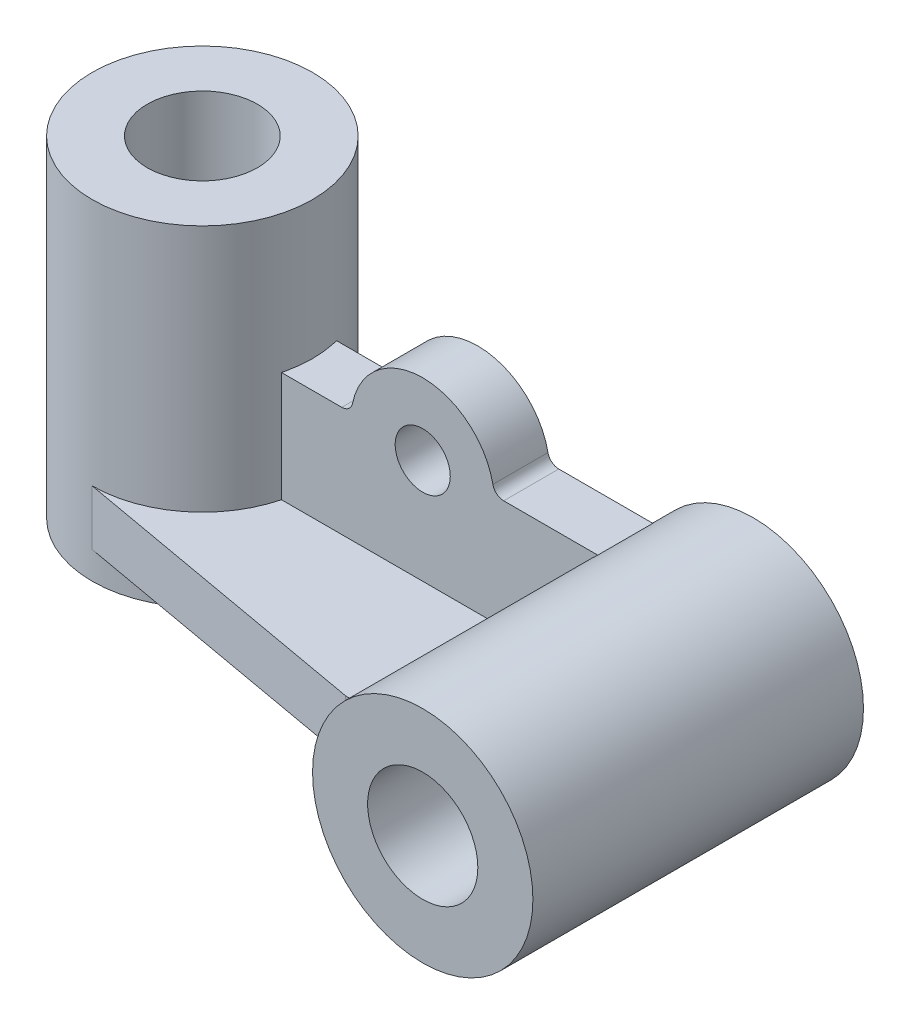
ISO-10303-21;
HEADER;
FILE_DESCRIPTION(('STEP AP214'),'2;1');
FILE_NAME('part.step','',(''),(''),'','','');
FILE_SCHEMA(('AUTOMOTIVE_DESIGN { 1 0 10303 214 1 1 1 1 }'));
ENDSEC;
DATA;
#1=APPLICATION_CONTEXT('core data for automotive mechanical design processes');
#2=APPLICATION_PROTOCOL_DEFINITION('international standard','automotive_design',2000,#1);
#3=PRODUCT_CONTEXT('',#1,'mechanical');
#4=PRODUCT('Part','Part','',(#3));
#5=PRODUCT_RELATED_PRODUCT_CATEGORY('part','',(#4));
#6=PRODUCT_DEFINITION_FORMATION('','',#4);
#7=PRODUCT_DEFINITION_CONTEXT('part definition',#1,'design');
#8=PRODUCT_DEFINITION('design','',#6,#7);
#9=PRODUCT_DEFINITION_SHAPE('','',#8);
#10=(LENGTH_UNIT() NAMED_UNIT(*) SI_UNIT(.MILLI.,.METRE.));
#11=(NAMED_UNIT(*) PLANE_ANGLE_UNIT() SI_UNIT($,.RADIAN.));
#12=(NAMED_UNIT(*) SI_UNIT($,.STERADIAN.) SOLID_ANGLE_UNIT());
#13=UNCERTAINTY_MEASURE_WITH_UNIT(LENGTH_MEASURE(1.E-05),#10,'distance_accuracy_value','');
#14=(GEOMETRIC_REPRESENTATION_CONTEXT(3) GLOBAL_UNCERTAINTY_ASSIGNED_CONTEXT((#13)) GLOBAL_UNIT_ASSIGNED_CONTEXT((#10,
#11,#12)) REPRESENTATION_CONTEXT('',''));
#15=CARTESIAN_POINT('',(0.,0.,0.));
#16=DIRECTION('',(0.,0.,1.));
#17=DIRECTION('',(1.,0.,0.));
#18=AXIS2_PLACEMENT_3D('',#15,#16,#17);
#19=CARTESIAN_POINT('',(77.3091008088365,-15.,30.));
#20=DIRECTION('',(-1.,0.,0.));
#21=DIRECTION('',(0.,0.,1.));
#22=AXIS2_PLACEMENT_3D('',#19,#20,#21);
#23=PLANE('',#22);
#24=DIRECTION('',(0.,0.,-1.));
#25=VECTOR('',#24,1.);
#26=CARTESIAN_POINT('',(77.3091008088365,-25.,30.));
#27=LINE('',#26,#25);
#28=CARTESIAN_POINT('',(77.3091008088365,-25.,30.));
#29=VERTEX_POINT('',#28);
#30=CARTESIAN_POINT('',(77.3091008088365,-25.,5.));
#31=VERTEX_POINT('',#30);
#32=EDGE_CURVE('E124',#29,#31,#27,.T.);
#33=ORIENTED_EDGE('',*,*,#32,.T.);
#34=DIRECTION('',(0.,-1.,0.));
#35=VECTOR('',#34,1.);
#36=CARTESIAN_POINT('',(77.3091008088365,-15.,5.));
#37=LINE('',#36,#35);
#38=CARTESIAN_POINT('',(77.3091008088365,-15.,5.));
#39=VERTEX_POINT('',#38);
#40=EDGE_CURVE('E12',#39,#31,#37,.T.);
#41=ORIENTED_EDGE('',*,*,#40,.F.);
#42=DIRECTION('',(0.,0.,-1.));
#43=VECTOR('',#42,1.);
#44=CARTESIAN_POINT('',(77.3091008088365,-15.,30.));
#45=LINE('',#44,#43);
#46=CARTESIAN_POINT('',(77.3091008088365,-15.,30.));
#47=VERTEX_POINT('',#46);
#48=EDGE_CURVE('E132',#47,#39,#45,.T.);
#49=ORIENTED_EDGE('',*,*,#48,.F.);
#50=DIRECTION('',(0.,-1.,0.));
#51=VECTOR('',#50,1.);
#52=CARTESIAN_POINT('',(77.3091008088365,-15.,30.));
#53=LINE('',#52,#51);
#54=EDGE_CURVE('E120',#47,#29,#53,.T.);
#55=ORIENTED_EDGE('',*,*,#54,.T.);
#56=EDGE_LOOP('',(#33,#41,#49,#55));
#57=FACE_BOUND('',#56,.T.);
#58=ADVANCED_FACE('F50',(#57),#23,.F.);
#59=CARTESIAN_POINT('',(19.3649167310371,-15.,5.));
#60=DIRECTION('',(0.,0.,1.));
#61=DIRECTION('',(1.,0.,0.));
#62=AXIS2_PLACEMENT_3D('',#59,#60,#61);
#63=PLANE('',#62);
#64=DIRECTION('',(-1.,0.,0.));
#65=VECTOR('',#64,1.);
#66=CARTESIAN_POINT('',(19.3649167310371,-25.,5.));
#67=LINE('',#66,#65);
#68=CARTESIAN_POINT('',(19.3649167310371,-25.,5.));
#69=VERTEX_POINT('',#68);
#70=EDGE_CURVE('E127',#31,#69,#67,.T.);
#71=ORIENTED_EDGE('',*,*,#70,.T.);
#72=DIRECTION('',(0.,-1.,0.));
#73=VECTOR('',#72,1.);
#74=CARTESIAN_POINT('',(19.3649167310371,-15.,5.));
#75=LINE('',#74,#73);
#76=CARTESIAN_POINT('',(19.3649167310371,-15.,5.));
#77=VERTEX_POINT('',#76);
#78=EDGE_CURVE('E58',#77,#69,#75,.T.);
#79=ORIENTED_EDGE('',*,*,#78,.F.);
#80=DIRECTION('',(-1.,0.,0.));
#81=VECTOR('',#80,1.);
#82=CARTESIAN_POINT('',(19.3649167310371,-15.,5.));
#83=LINE('',#82,#81);
#84=EDGE_CURVE('E100',#39,#77,#83,.T.);
#85=ORIENTED_EDGE('',*,*,#84,.F.);
#86=ORIENTED_EDGE('',*,*,#40,.T.);
#87=EDGE_LOOP('',(#71,#79,#85,#86));
#88=FACE_BOUND('',#87,.T.);
#89=ADVANCED_FACE('F151',(#88),#63,.F.);
#90=CARTESIAN_POINT('',(0.,-15.,0.));
#91=DIRECTION('',(0.,-1.,0.));
#92=DIRECTION('',(0.,0.,-1.));
#93=AXIS2_PLACEMENT_3D('',#90,#91,#92);
#94=CYLINDRICAL_SURFACE('',#93,20.);
#95=CARTESIAN_POINT('',(0.,-25.,0.));
#96=DIRECTION('',(0.,-1.,0.));
#97=DIRECTION('',(0.,0.,1.));
#98=AXIS2_PLACEMENT_3D('',#95,#96,#97);
#99=CIRCLE('',#98,20.);
#100=CARTESIAN_POINT('',(0.,-25.,20.));
#101=VERTEX_POINT('',#100);
#102=EDGE_CURVE('E115',#69,#101,#99,.T.);
#103=ORIENTED_EDGE('',*,*,#102,.T.);
#104=DIRECTION('',(0.,-1.,0.));
#105=VECTOR('',#104,1.);
#106=CARTESIAN_POINT('',(0.,-15.,20.));
#107=LINE('',#106,#105);
#108=CARTESIAN_POINT('',(0.,-15.,20.));
#109=VERTEX_POINT('',#108);
#110=EDGE_CURVE('E112',#109,#101,#107,.T.);
#111=ORIENTED_EDGE('',*,*,#110,.F.);
#112=CARTESIAN_POINT('',(0.,-15.,0.));
#113=DIRECTION('',(0.,-1.,0.));
#114=DIRECTION('',(0.,0.,1.));
#115=AXIS2_PLACEMENT_3D('',#112,#113,#114);
#116=CIRCLE('',#115,20.);
#117=EDGE_CURVE('E104',#77,#109,#116,.T.);
#118=ORIENTED_EDGE('',*,*,#117,.F.);
#119=ORIENTED_EDGE('',*,*,#78,.T.);
#120=EDGE_LOOP('',(#103,#111,#118,#119));
#121=FACE_BOUND('',#120,.T.);
#122=ADVANCED_FACE('F113',(#121),#94,.F.);
#123=CARTESIAN_POINT('',(0.,-15.,20.));
#124=DIRECTION('',(0.175790638483658,0.,-0.984427575508482));
#125=DIRECTION('',(-0.984427575508482,0.,-0.175790638483658));
#126=AXIS2_PLACEMENT_3D('',#123,#124,#125);
#127=PLANE('',#126);
#128=DIRECTION('',(0.984427575508482,0.,0.175790638483658));
#129=VECTOR('',#128,1.);
#130=CARTESIAN_POINT('',(0.,-25.,20.));
#131=LINE('',#130,#129);
#132=CARTESIAN_POINT('',(56.,-25.,30.));
#133=VERTEX_POINT('',#132);
#134=EDGE_CURVE('E86',#101,#133,#131,.T.);
#135=ORIENTED_EDGE('',*,*,#134,.T.);
#136=DIRECTION('',(0.,-1.,0.));
#137=VECTOR('',#136,1.);
#138=CARTESIAN_POINT('',(56.,-15.,30.));
#139=LINE('',#138,#137);
#140=CARTESIAN_POINT('',(56.,-15.,30.));
#141=VERTEX_POINT('',#140);
#142=EDGE_CURVE('E116',#141,#133,#139,.T.);
#143=ORIENTED_EDGE('',*,*,#142,.F.);
#144=DIRECTION('',(0.984427575508482,0.,0.175790638483658));
#145=VECTOR('',#144,1.);
#146=CARTESIAN_POINT('',(0.,-15.,20.));
#147=LINE('',#146,#145);
#148=EDGE_CURVE('E108',#109,#141,#147,.T.);
#149=ORIENTED_EDGE('',*,*,#148,.F.);
#150=ORIENTED_EDGE('',*,*,#110,.T.);
#151=EDGE_LOOP('',(#135,#143,#149,#150));
#152=FACE_BOUND('',#151,.T.);
#153=ADVANCED_FACE('F118',(#152),#127,.F.);
#154=CARTESIAN_POINT('',(56.,-15.,30.));
#155=DIRECTION('',(0.,0.,-1.));
#156=DIRECTION('',(-1.,0.,0.));
#157=AXIS2_PLACEMENT_3D('',#154,#155,#156);
#158=PLANE('',#157);
#159=DIRECTION('',(1.,0.,0.));
#160=VECTOR('',#159,1.);
#161=CARTESIAN_POINT('',(56.,-25.,30.));
#162=LINE('',#161,#160);
#163=EDGE_CURVE('E92',#133,#29,#162,.T.);
#164=ORIENTED_EDGE('',*,*,#163,.T.);
#165=ORIENTED_EDGE('',*,*,#54,.F.);
#166=DIRECTION('',(1.,0.,0.));
#167=VECTOR('',#166,1.);
#168=CARTESIAN_POINT('',(56.,-15.,30.));
#169=LINE('',#168,#167);
#170=EDGE_CURVE('E66',#141,#47,#169,.T.);
#171=ORIENTED_EDGE('',*,*,#170,.F.);
#172=ORIENTED_EDGE('',*,*,#142,.T.);
#173=EDGE_LOOP('',(#164,#165,#171,#172));
#174=FACE_BOUND('',#173,.T.);
#175=ADVANCED_FACE('F140',(#174),#158,.F.);
#176=CARTESIAN_POINT('',(0.,-15.,0.));
#177=DIRECTION('',(0.,1.,0.));
#178=DIRECTION('',(0.,0.,1.));
#179=AXIS2_PLACEMENT_3D('',#176,#177,#178);
#180=PLANE('',#179);
#181=ORIENTED_EDGE('',*,*,#48,.T.);
#182=ORIENTED_EDGE('',*,*,#84,.T.);
#183=ORIENTED_EDGE('',*,*,#117,.T.);
#184=ORIENTED_EDGE('',*,*,#148,.T.);
#185=ORIENTED_EDGE('',*,*,#170,.T.);
#186=EDGE_LOOP('',(#181,#182,#183,#184,#185));
#187=FACE_BOUND('',#186,.T.);
#188=ADVANCED_FACE('F106',(#187),#180,.T.);
#189=CARTESIAN_POINT('',(0.,-25.,0.));
#190=DIRECTION('',(0.,1.,0.));
#191=DIRECTION('',(0.,0.,1.));
#192=AXIS2_PLACEMENT_3D('',#189,#190,#191);
#193=PLANE('',#192);
#194=ORIENTED_EDGE('',*,*,#32,.F.);
#195=ORIENTED_EDGE('',*,*,#163,.F.);
#196=ORIENTED_EDGE('',*,*,#134,.F.);
#197=ORIENTED_EDGE('',*,*,#102,.F.);
#198=ORIENTED_EDGE('',*,*,#70,.F.);
#199=EDGE_LOOP('',(#194,#195,#196,#197,#198));
#200=FACE_BOUND('',#199,.T.);
#201=ADVANCED_FACE('F136',(#200),#193,.F.);
#202=CLOSED_SHELL('',(#58,#89,#122,#153,#175,#188,#201));
#203=MANIFOLD_SOLID_BREP('B2',#202);
#204=CARTESIAN_POINT('',(90.0000000000001,-10.,5.));
#205=DIRECTION('',(0.,0.,-1.));
#206=DIRECTION('',(-1.,0.,0.));
#207=AXIS2_PLACEMENT_3D('',#204,#205,#206);
#208=PLANE('',#207);
#209=DIRECTION('',(0.,-1.,0.));
#210=VECTOR('',#209,1.);
#211=CARTESIAN_POINT('',(10.,5.,5.));
#212=LINE('',#211,#210);
#213=CARTESIAN_POINT('',(10.,5.,5.));
#214=VERTEX_POINT('',#213);
#215=CARTESIAN_POINT('',(10.,-15.,5.));
#216=VERTEX_POINT('',#215);
#217=EDGE_CURVE('E320',#214,#216,#212,.T.);
#218=ORIENTED_EDGE('',*,*,#217,.T.);
#219=DIRECTION('',(1.,0.,0.));
#220=VECTOR('',#219,1.);
#221=CARTESIAN_POINT('',(10.,-15.,5.));
#222=LINE('',#221,#220);
#223=CARTESIAN_POINT('',(70.6350832689629,-15.,5.));
#224=VERTEX_POINT('',#223);
#225=EDGE_CURVE('E268',#216,#224,#222,.T.);
#226=ORIENTED_EDGE('',*,*,#225,.T.);
#227=CARTESIAN_POINT('',(90.0000000000001,-10.,5.));
#228=DIRECTION('',(0.,0.,-1.));
#229=DIRECTION('',(-1.,0.,0.));
#230=AXIS2_PLACEMENT_3D('',#227,#228,#229);
#231=CIRCLE('',#230,20.);
#232=CARTESIAN_POINT('',(76.7712434446771,5.,5.));
#233=VERTEX_POINT('',#232);
#234=EDGE_CURVE('E335',#224,#233,#231,.T.);
#235=ORIENTED_EDGE('',*,*,#234,.T.);
#236=DIRECTION('',(-1.,0.,0.));
#237=VECTOR('',#236,1.);
#238=CARTESIAN_POINT('',(59.6969384566991,5.,5.));
#239=LINE('',#238,#237);
#240=CARTESIAN_POINT('',(59.6969384566991,5.,5.));
#241=VERTEX_POINT('',#240);
#242=EDGE_CURVE('E348',#233,#241,#239,.T.);
#243=ORIENTED_EDGE('',*,*,#242,.T.);
#244=CARTESIAN_POINT('',(59.6969384566991,7.,5.));
#245=DIRECTION('',(0.,0.,-1.));
#246=DIRECTION('',(-1.,0.,0.));
#247=AXIS2_PLACEMENT_3D('',#244,#245,#246);
#248=CIRCLE('',#247,2.);
#249=CARTESIAN_POINT('',(57.7373466624725,6.6,5.));
#250=VERTEX_POINT('',#249);
#251=EDGE_CURVE('E287',#241,#250,#248,.T.);
#252=ORIENTED_EDGE('',*,*,#251,.T.);
#253=CARTESIAN_POINT('',(45.,4.,5.));
#254=DIRECTION('',(0.,0.,1.));
#255=DIRECTION('',(-1.,0.,0.));
#256=AXIS2_PLACEMENT_3D('',#253,#254,#255);
#257=CIRCLE('',#256,13.);
#258=CARTESIAN_POINT('',(32.2626533375275,6.6,5.));
#259=VERTEX_POINT('',#258);
#260=EDGE_CURVE('E281',#250,#259,#257,.T.);
#261=ORIENTED_EDGE('',*,*,#260,.T.);
#262=CARTESIAN_POINT('',(30.303061543301,7.,5.));
#263=DIRECTION('',(0.,0.,-1.));
#264=DIRECTION('',(1.,0.,0.));
#265=AXIS2_PLACEMENT_3D('',#262,#263,#264);
#266=CIRCLE('',#265,2.);
#267=CARTESIAN_POINT('',(30.303061543301,5.,5.));
#268=VERTEX_POINT('',#267);
#269=EDGE_CURVE('E285',#259,#268,#266,.T.);
#270=ORIENTED_EDGE('',*,*,#269,.T.);
#271=DIRECTION('',(-1.,0.,0.));
#272=VECTOR('',#271,1.);
#273=CARTESIAN_POINT('',(10.,5.,5.));
#274=LINE('',#273,#272);
#275=EDGE_CURVE('E225',#268,#214,#274,.T.);
#276=ORIENTED_EDGE('',*,*,#275,.T.);
#277=EDGE_LOOP('',(#218,#226,#235,#243,#252,#261,#270,#276));
#278=FACE_BOUND('',#277,.T.);
#279=CARTESIAN_POINT('',(45.,4.,5.));
#280=DIRECTION('',(0.,0.,1.));
#281=DIRECTION('',(1.,0.,0.));
#282=AXIS2_PLACEMENT_3D('',#279,#280,#281);
#283=CIRCLE('',#282,5.);
#284=CARTESIAN_POINT('',(50.,4.,5.));
#285=VERTEX_POINT('',#284);
#286=EDGE_CURVE('E309',#285,#285,#283,.T.);
#287=ORIENTED_EDGE('',*,*,#286,.F.);
#288=EDGE_LOOP('',(#287));
#289=FACE_BOUND('',#288,.T.);
#290=ADVANCED_FACE('F208',(#278,#289),#208,.F.);
#291=CARTESIAN_POINT('',(90.0000000000001,-10.,-5.));
#292=DIRECTION('',(0.,0.,-1.));
#293=DIRECTION('',(-1.,0.,0.));
#294=AXIS2_PLACEMENT_3D('',#291,#292,#293);
#295=PLANE('',#294);
#296=DIRECTION('',(0.,-1.,0.));
#297=VECTOR('',#296,1.);
#298=CARTESIAN_POINT('',(10.,5.,-5.));
#299=LINE('',#298,#297);
#300=CARTESIAN_POINT('',(10.,5.,-5.));
#301=VERTEX_POINT('',#300);
#302=CARTESIAN_POINT('',(10.,-15.,-5.));
#303=VERTEX_POINT('',#302);
#304=EDGE_CURVE('E305',#301,#303,#299,.T.);
#305=ORIENTED_EDGE('',*,*,#304,.F.);
#306=DIRECTION('',(-1.,0.,0.));
#307=VECTOR('',#306,1.);
#308=CARTESIAN_POINT('',(10.,5.,-5.));
#309=LINE('',#308,#307);
#310=CARTESIAN_POINT('',(30.303061543301,5.,-5.));
#311=VERTEX_POINT('',#310);
#312=EDGE_CURVE('E260',#311,#301,#309,.T.);
#313=ORIENTED_EDGE('',*,*,#312,.F.);
#314=CARTESIAN_POINT('',(30.303061543301,7.,-5.));
#315=DIRECTION('',(0.,0.,-1.));
#316=DIRECTION('',(1.,0.,0.));
#317=AXIS2_PLACEMENT_3D('',#314,#315,#316);
#318=CIRCLE('',#317,2.);
#319=CARTESIAN_POINT('',(32.2626533375275,6.6,-5.));
#320=VERTEX_POINT('',#319);
#321=EDGE_CURVE('E254',#320,#311,#318,.T.);
#322=ORIENTED_EDGE('',*,*,#321,.F.);
#323=CARTESIAN_POINT('',(45.,4.,-5.));
#324=DIRECTION('',(0.,0.,1.));
#325=DIRECTION('',(-1.,0.,0.));
#326=AXIS2_PLACEMENT_3D('',#323,#324,#325);
#327=CIRCLE('',#326,13.);
#328=CARTESIAN_POINT('',(57.7373466624725,6.6,-5.));
#329=VERTEX_POINT('',#328);
#330=EDGE_CURVE('E295',#329,#320,#327,.T.);
#331=ORIENTED_EDGE('',*,*,#330,.F.);
#332=CARTESIAN_POINT('',(59.6969384566991,7.,-5.));
#333=DIRECTION('',(0.,0.,-1.));
#334=DIRECTION('',(-1.,0.,0.));
#335=AXIS2_PLACEMENT_3D('',#332,#333,#334);
#336=CIRCLE('',#335,2.);
#337=CARTESIAN_POINT('',(59.6969384566991,5.,-5.));
#338=VERTEX_POINT('',#337);
#339=EDGE_CURVE('E315',#338,#329,#336,.T.);
#340=ORIENTED_EDGE('',*,*,#339,.F.);
#341=DIRECTION('',(-1.,0.,0.));
#342=VECTOR('',#341,1.);
#343=CARTESIAN_POINT('',(59.6969384566991,5.,-5.));
#344=LINE('',#343,#342);
#345=CARTESIAN_POINT('',(76.7712434446771,5.,-5.));
#346=VERTEX_POINT('',#345);
#347=EDGE_CURVE('E313',#346,#338,#344,.T.);
#348=ORIENTED_EDGE('',*,*,#347,.F.);
#349=CARTESIAN_POINT('',(90.0000000000001,-10.,-5.));
#350=DIRECTION('',(0.,0.,-1.));
#351=DIRECTION('',(-1.,0.,0.));
#352=AXIS2_PLACEMENT_3D('',#349,#350,#351);
#353=CIRCLE('',#352,20.);
#354=CARTESIAN_POINT('',(70.6350832689629,-15.,-5.));
#355=VERTEX_POINT('',#354);
#356=EDGE_CURVE('E311',#355,#346,#353,.T.);
#357=ORIENTED_EDGE('',*,*,#356,.F.);
#358=DIRECTION('',(1.,0.,0.));
#359=VECTOR('',#358,1.);
#360=CARTESIAN_POINT('',(10.,-15.,-5.));
#361=LINE('',#360,#359);
#362=EDGE_CURVE('E308',#303,#355,#361,.T.);
#363=ORIENTED_EDGE('',*,*,#362,.F.);
#364=EDGE_LOOP('',(#305,#313,#322,#331,#340,#348,#357,#363));
#365=FACE_BOUND('',#364,.T.);
#366=CARTESIAN_POINT('',(45.,4.,-5.));
#367=DIRECTION('',(0.,0.,1.));
#368=DIRECTION('',(1.,0.,0.));
#369=AXIS2_PLACEMENT_3D('',#366,#367,#368);
#370=CIRCLE('',#369,5.);
#371=CARTESIAN_POINT('',(50.,4.,-5.));
#372=VERTEX_POINT('',#371);
#373=EDGE_CURVE('E354',#372,#372,#370,.T.);
#374=ORIENTED_EDGE('',*,*,#373,.T.);
#375=EDGE_LOOP('',(#374));
#376=FACE_BOUND('',#375,.T.);
#377=ADVANCED_FACE('F339',(#365,#376),#295,.T.);
#378=CARTESIAN_POINT('',(10.,5.,5.));
#379=DIRECTION('',(1.,0.,0.));
#380=DIRECTION('',(0.,1.,0.));
#381=AXIS2_PLACEMENT_3D('',#378,#379,#380);
#382=PLANE('',#381);
#383=ORIENTED_EDGE('',*,*,#304,.T.);
#384=DIRECTION('',(0.,0.,-1.));
#385=VECTOR('',#384,1.);
#386=CARTESIAN_POINT('',(10.,-15.,5.));
#387=LINE('',#386,#385);
#388=EDGE_CURVE('E48',#216,#303,#387,.T.);
#389=ORIENTED_EDGE('',*,*,#388,.F.);
#390=ORIENTED_EDGE('',*,*,#217,.F.);
#391=DIRECTION('',(0.,0.,-1.));
#392=VECTOR('',#391,1.);
#393=CARTESIAN_POINT('',(10.,5.,5.));
#394=LINE('',#393,#392);
#395=EDGE_CURVE('E301',#214,#301,#394,.T.);
#396=ORIENTED_EDGE('',*,*,#395,.T.);
#397=EDGE_LOOP('',(#383,#389,#390,#396));
#398=FACE_BOUND('',#397,.T.);
#399=ADVANCED_FACE('F210',(#398),#382,.F.);
#400=CARTESIAN_POINT('',(10.,-15.,5.));
#401=DIRECTION('',(0.,1.,0.));
#402=DIRECTION('',(0.,0.,1.));
#403=AXIS2_PLACEMENT_3D('',#400,#401,#402);
#404=PLANE('',#403);
#405=ORIENTED_EDGE('',*,*,#362,.T.);
#406=DIRECTION('',(0.,0.,-1.));
#407=VECTOR('',#406,1.);
#408=CARTESIAN_POINT('',(70.6350832689629,-15.,5.));
#409=LINE('',#408,#407);
#410=EDGE_CURVE('E217',#224,#355,#409,.T.);
#411=ORIENTED_EDGE('',*,*,#410,.F.);
#412=ORIENTED_EDGE('',*,*,#225,.F.);
#413=ORIENTED_EDGE('',*,*,#388,.T.);
#414=EDGE_LOOP('',(#405,#411,#412,#413));
#415=FACE_BOUND('',#414,.T.);
#416=ADVANCED_FACE('F382',(#415),#404,.F.);
#417=CARTESIAN_POINT('',(90.0000000000001,-10.,5.));
#418=DIRECTION('',(0.,0.,-1.));
#419=DIRECTION('',(-1.,0.,0.));
#420=AXIS2_PLACEMENT_3D('',#417,#418,#419);
#421=CYLINDRICAL_SURFACE('',#420,20.);
#422=ORIENTED_EDGE('',*,*,#356,.T.);
#423=DIRECTION('',(0.,0.,-1.));
#424=VECTOR('',#423,1.);
#425=CARTESIAN_POINT('',(76.7712434446771,5.,5.));
#426=LINE('',#425,#424);
#427=EDGE_CURVE('E327',#233,#346,#426,.T.);
#428=ORIENTED_EDGE('',*,*,#427,.F.);
#429=ORIENTED_EDGE('',*,*,#234,.F.);
#430=ORIENTED_EDGE('',*,*,#410,.T.);
#431=EDGE_LOOP('',(#422,#428,#429,#430));
#432=FACE_BOUND('',#431,.T.);
#433=ADVANCED_FACE('F333',(#432),#421,.F.);
#434=CARTESIAN_POINT('',(59.6969384566991,5.,5.));
#435=DIRECTION('',(0.,-1.,0.));
#436=DIRECTION('',(0.,0.,-1.));
#437=AXIS2_PLACEMENT_3D('',#434,#435,#436);
#438=PLANE('',#437);
#439=ORIENTED_EDGE('',*,*,#347,.T.);
#440=DIRECTION('',(0.,0.,-1.));
#441=VECTOR('',#440,1.);
#442=CARTESIAN_POINT('',(59.6969384566991,5.,5.));
#443=LINE('',#442,#441);
#444=EDGE_CURVE('E324',#241,#338,#443,.T.);
#445=ORIENTED_EDGE('',*,*,#444,.F.);
#446=ORIENTED_EDGE('',*,*,#242,.F.);
#447=ORIENTED_EDGE('',*,*,#427,.T.);
#448=EDGE_LOOP('',(#439,#445,#446,#447));
#449=FACE_BOUND('',#448,.T.);
#450=ADVANCED_FACE('F344',(#449),#438,.F.);
#451=CARTESIAN_POINT('',(59.6969384566991,7.,5.));
#452=DIRECTION('',(0.,0.,-1.));
#453=DIRECTION('',(-1.,0.,0.));
#454=AXIS2_PLACEMENT_3D('',#451,#452,#453);
#455=CYLINDRICAL_SURFACE('',#454,2.);
#456=ORIENTED_EDGE('',*,*,#339,.T.);
#457=DIRECTION('',(0.,0.,-1.));
#458=VECTOR('',#457,1.);
#459=CARTESIAN_POINT('',(57.7373466624725,6.6,5.));
#460=LINE('',#459,#458);
#461=EDGE_CURVE('E296',#250,#329,#460,.T.);
#462=ORIENTED_EDGE('',*,*,#461,.F.);
#463=ORIENTED_EDGE('',*,*,#251,.F.);
#464=ORIENTED_EDGE('',*,*,#444,.T.);
#465=EDGE_LOOP('',(#456,#462,#463,#464));
#466=FACE_BOUND('',#465,.T.);
#467=ADVANCED_FACE('F347',(#466),#455,.F.);
#468=CARTESIAN_POINT('',(45.,4.,5.));
#469=DIRECTION('',(0.,0.,-1.));
#470=DIRECTION('',(-1.,0.,0.));
#471=AXIS2_PLACEMENT_3D('',#468,#469,#470);
#472=CYLINDRICAL_SURFACE('',#471,13.);
#473=ORIENTED_EDGE('',*,*,#330,.T.);
#474=DIRECTION('',(0.,0.,-1.));
#475=VECTOR('',#474,1.);
#476=CARTESIAN_POINT('',(32.2626533375275,6.6,5.));
#477=LINE('',#476,#475);
#478=EDGE_CURVE('E292',#259,#320,#477,.T.);
#479=ORIENTED_EDGE('',*,*,#478,.F.);
#480=ORIENTED_EDGE('',*,*,#260,.F.);
#481=ORIENTED_EDGE('',*,*,#461,.T.);
#482=EDGE_LOOP('',(#473,#479,#480,#481));
#483=FACE_BOUND('',#482,.T.);
#484=ADVANCED_FACE('F293',(#483),#472,.T.);
#485=CARTESIAN_POINT('',(30.303061543301,7.,5.));
#486=DIRECTION('',(0.,0.,-1.));
#487=DIRECTION('',(-1.,0.,0.));
#488=AXIS2_PLACEMENT_3D('',#485,#486,#487);
#489=CYLINDRICAL_SURFACE('',#488,2.);
#490=ORIENTED_EDGE('',*,*,#321,.T.);
#491=DIRECTION('',(0.,0.,-1.));
#492=VECTOR('',#491,1.);
#493=CARTESIAN_POINT('',(30.303061543301,5.,5.));
#494=LINE('',#493,#492);
#495=EDGE_CURVE('E297',#268,#311,#494,.T.);
#496=ORIENTED_EDGE('',*,*,#495,.F.);
#497=ORIENTED_EDGE('',*,*,#269,.F.);
#498=ORIENTED_EDGE('',*,*,#478,.T.);
#499=EDGE_LOOP('',(#490,#496,#497,#498));
#500=FACE_BOUND('',#499,.T.);
#501=ADVANCED_FACE('F299',(#500),#489,.F.);
#502=CARTESIAN_POINT('',(10.,5.,5.));
#503=DIRECTION('',(0.,-1.,0.));
#504=DIRECTION('',(0.,0.,-1.));
#505=AXIS2_PLACEMENT_3D('',#502,#503,#504);
#506=PLANE('',#505);
#507=ORIENTED_EDGE('',*,*,#312,.T.);
#508=ORIENTED_EDGE('',*,*,#395,.F.);
#509=ORIENTED_EDGE('',*,*,#275,.F.);
#510=ORIENTED_EDGE('',*,*,#495,.T.);
#511=EDGE_LOOP('',(#507,#508,#509,#510));
#512=FACE_BOUND('',#511,.T.);
#513=ADVANCED_FACE('F370',(#512),#506,.F.);
#514=CARTESIAN_POINT('',(45.,4.,5.));
#515=DIRECTION('',(0.,0.,-1.));
#516=DIRECTION('',(-1.,0.,0.));
#517=AXIS2_PLACEMENT_3D('',#514,#515,#516);
#518=CYLINDRICAL_SURFACE('',#517,5.);
#519=ORIENTED_EDGE('',*,*,#286,.T.);
#520=EDGE_LOOP('',(#519));
#521=FACE_BOUND('',#520,.T.);
#522=ORIENTED_EDGE('',*,*,#373,.F.);
#523=EDGE_LOOP('',(#522));
#524=FACE_BOUND('',#523,.T.);
#525=ADVANCED_FACE('F360',(#521,#524),#518,.F.);
#526=CLOSED_SHELL('',(#290,#377,#399,#416,#433,#450,#467,#484,#501,#513,#525));
#527=MANIFOLD_SOLID_BREP('B6',#526);
#528=CARTESIAN_POINT('',(90.,-10.,-9.99999999999999));
#529=DIRECTION('',(0.,0.,1.));
#530=DIRECTION('',(1.,0.,0.));
#531=AXIS2_PLACEMENT_3D('',#528,#529,#530);
#532=CYLINDRICAL_SURFACE('',#531,20.);
#533=CARTESIAN_POINT('',(90.,-10.,-9.99999999999999));
#534=DIRECTION('',(0.,0.,1.));
#535=DIRECTION('',(1.,0.,0.));
#536=AXIS2_PLACEMENT_3D('',#533,#534,#535);
#537=CIRCLE('',#536,20.);
#538=CARTESIAN_POINT('',(110.,-10.,-9.99999999999999));
#539=VERTEX_POINT('',#538);
#540=EDGE_CURVE('E207',#539,#539,#537,.T.);
#541=ORIENTED_EDGE('',*,*,#540,.T.);
#542=EDGE_LOOP('',(#541));
#543=FACE_BOUND('',#542,.T.);
#544=CARTESIAN_POINT('',(90.,-10.,50.));
#545=DIRECTION('',(0.,0.,1.));
#546=DIRECTION('',(1.,0.,0.));
#547=AXIS2_PLACEMENT_3D('',#544,#545,#546);
#548=CIRCLE('',#547,20.);
#549=CARTESIAN_POINT('',(110.,-10.,50.));
#550=VERTEX_POINT('',#549);
#551=EDGE_CURVE('E467',#550,#550,#548,.T.);
#552=ORIENTED_EDGE('',*,*,#551,.F.);
#553=EDGE_LOOP('',(#552));
#554=FACE_BOUND('',#553,.T.);
#555=ADVANCED_FACE('F464',(#543,#554),#532,.T.);
#556=CARTESIAN_POINT('',(90.,-10.,-9.99999999999999));
#557=DIRECTION('',(0.,0.,1.));
#558=DIRECTION('',(1.,0.,0.));
#559=AXIS2_PLACEMENT_3D('',#556,#557,#558);
#560=PLANE('',#559);
#561=CARTESIAN_POINT('',(90.,-10.,-9.99999999999999));
#562=DIRECTION('',(0.,0.,1.));
#563=DIRECTION('',(1.,0.,0.));
#564=AXIS2_PLACEMENT_3D('',#561,#562,#563);
#565=CIRCLE('',#564,9.99999999999999);
#566=CARTESIAN_POINT('',(100.,-10.,-9.99999999999999));
#567=VERTEX_POINT('',#566);
#568=EDGE_CURVE('E474',#567,#567,#565,.T.);
#569=ORIENTED_EDGE('',*,*,#568,.T.);
#570=EDGE_LOOP('',(#569));
#571=FACE_BOUND('',#570,.T.);
#572=ORIENTED_EDGE('',*,*,#540,.F.);
#573=EDGE_LOOP('',(#572));
#574=FACE_BOUND('',#573,.T.);
#575=ADVANCED_FACE('F482',(#571,#574),#560,.F.);
#576=CARTESIAN_POINT('',(90.,-10.,50.));
#577=DIRECTION('',(0.,0.,1.));
#578=DIRECTION('',(1.,0.,0.));
#579=AXIS2_PLACEMENT_3D('',#576,#577,#578);
#580=PLANE('',#579);
#581=CARTESIAN_POINT('',(90.,-10.,50.));
#582=DIRECTION('',(0.,0.,1.));
#583=DIRECTION('',(1.,0.,0.));
#584=AXIS2_PLACEMENT_3D('',#581,#582,#583);
#585=CIRCLE('',#584,9.99999999999999);
#586=CARTESIAN_POINT('',(100.,-10.,50.));
#587=VERTEX_POINT('',#586);
#588=EDGE_CURVE('E476',#587,#587,#585,.T.);
#589=ORIENTED_EDGE('',*,*,#588,.F.);
#590=EDGE_LOOP('',(#589));
#591=FACE_BOUND('',#590,.T.);
#592=ORIENTED_EDGE('',*,*,#551,.T.);
#593=EDGE_LOOP('',(#592));
#594=FACE_BOUND('',#593,.T.);
#595=ADVANCED_FACE('F488',(#591,#594),#580,.T.);
#596=CARTESIAN_POINT('',(90.,-10.,-9.99999999999999));
#597=DIRECTION('',(0.,0.,1.));
#598=DIRECTION('',(1.,0.,0.));
#599=AXIS2_PLACEMENT_3D('',#596,#597,#598);
#600=CYLINDRICAL_SURFACE('',#599,9.99999999999999);
#601=ORIENTED_EDGE('',*,*,#568,.F.);
#602=EDGE_LOOP('',(#601));
#603=FACE_BOUND('',#602,.T.);
#604=ORIENTED_EDGE('',*,*,#588,.T.);
#605=EDGE_LOOP('',(#604));
#606=FACE_BOUND('',#605,.T.);
#607=ADVANCED_FACE('F485',(#603,#606),#600,.F.);
#608=CLOSED_SHELL('',(#555,#575,#595,#607));
#609=MANIFOLD_SOLID_BREP('B42',#608);
#610=CARTESIAN_POINT('',(0.,30.,0.));
#611=DIRECTION('',(0.,-1.,0.));
#612=DIRECTION('',(0.,0.,-1.));
#613=AXIS2_PLACEMENT_3D('',#610,#611,#612);
#614=PLANE('',#613);
#615=CARTESIAN_POINT('',(0.,30.,0.));
#616=DIRECTION('',(0.,1.,0.));
#617=DIRECTION('',(0.,0.,1.));
#618=AXIS2_PLACEMENT_3D('',#615,#616,#617);
#619=CIRCLE('',#618,10.);
#620=CARTESIAN_POINT('',(0.,30.,10.));
#621=VERTEX_POINT('',#620);
#622=EDGE_CURVE('E463',#621,#621,#619,.T.);
#623=ORIENTED_EDGE('',*,*,#622,.F.);
#624=EDGE_LOOP('',(#623));
#625=FACE_BOUND('',#624,.T.);
#626=CARTESIAN_POINT('',(0.,30.,0.));
#627=DIRECTION('',(0.,1.,0.));
#628=DIRECTION('',(0.,0.,1.));
#629=AXIS2_PLACEMENT_3D('',#626,#627,#628);
#630=CIRCLE('',#629,20.);
#631=CARTESIAN_POINT('',(0.,30.,20.));
#632=VERTEX_POINT('',#631);
#633=EDGE_CURVE('E540',#632,#632,#630,.T.);
#634=ORIENTED_EDGE('',*,*,#633,.T.);
#635=EDGE_LOOP('',(#634));
#636=FACE_BOUND('',#635,.T.);
#637=ADVANCED_FACE('F526',(#625,#636),#614,.F.);
#638=CARTESIAN_POINT('',(0.,30.,0.));
#639=DIRECTION('',(0.,1.,0.));
#640=DIRECTION('',(0.,0.,1.));
#641=AXIS2_PLACEMENT_3D('',#638,#639,#640);
#642=CYLINDRICAL_SURFACE('',#641,10.);
#643=CARTESIAN_POINT('',(0.,-30.,0.));
#644=DIRECTION('',(0.,1.,0.));
#645=DIRECTION('',(0.,0.,1.));
#646=AXIS2_PLACEMENT_3D('',#643,#644,#645);
#647=CIRCLE('',#646,10.);
#648=CARTESIAN_POINT('',(0.,-30.,10.));
#649=VERTEX_POINT('',#648);
#650=EDGE_CURVE('E532',#649,#649,#647,.T.);
#651=ORIENTED_EDGE('',*,*,#650,.F.);
#652=EDGE_LOOP('',(#651));
#653=FACE_BOUND('',#652,.T.);
#654=ORIENTED_EDGE('',*,*,#622,.T.);
#655=EDGE_LOOP('',(#654));
#656=FACE_BOUND('',#655,.T.);
#657=ADVANCED_FACE('F555',(#653,#656),#642,.F.);
#658=CARTESIAN_POINT('',(0.,-30.,0.));
#659=DIRECTION('',(0.,1.,0.));
#660=DIRECTION('',(0.,0.,1.));
#661=AXIS2_PLACEMENT_3D('',#658,#659,#660);
#662=PLANE('',#661);
#663=CARTESIAN_POINT('',(0.,-30.,0.));
#664=DIRECTION('',(0.,1.,0.));
#665=DIRECTION('',(0.,0.,1.));
#666=AXIS2_PLACEMENT_3D('',#663,#664,#665);
#667=CIRCLE('',#666,20.);
#668=CARTESIAN_POINT('',(0.,-30.,20.));
#669=VERTEX_POINT('',#668);
#670=EDGE_CURVE('E536',#669,#669,#667,.T.);
#671=ORIENTED_EDGE('',*,*,#670,.F.);
#672=EDGE_LOOP('',(#671));
#673=FACE_BOUND('',#672,.T.);
#674=ORIENTED_EDGE('',*,*,#650,.T.);
#675=EDGE_LOOP('',(#674));
#676=FACE_BOUND('',#675,.T.);
#677=ADVANCED_FACE('F550',(#673,#676),#662,.F.);
#678=CARTESIAN_POINT('',(0.,30.,0.));
#679=DIRECTION('',(0.,1.,0.));
#680=DIRECTION('',(0.,0.,1.));
#681=AXIS2_PLACEMENT_3D('',#678,#679,#680);
#682=CYLINDRICAL_SURFACE('',#681,20.);
#683=ORIENTED_EDGE('',*,*,#633,.F.);
#684=EDGE_LOOP('',(#683));
#685=FACE_BOUND('',#684,.T.);
#686=ORIENTED_EDGE('',*,*,#670,.T.);
#687=EDGE_LOOP('',(#686));
#688=FACE_BOUND('',#687,.T.);
#689=ADVANCED_FACE('F547',(#685,#688),#682,.T.);
#690=CLOSED_SHELL('',(#637,#657,#677,#689));
#691=MANIFOLD_SOLID_BREP('B202',#690);
#692=ADVANCED_BREP_SHAPE_REPRESENTATION('',(#18,#203,#527,#609,#691),#14);
#693=SHAPE_DEFINITION_REPRESENTATION(#9,#692);
ENDSEC;
END-ISO-10303-21;
